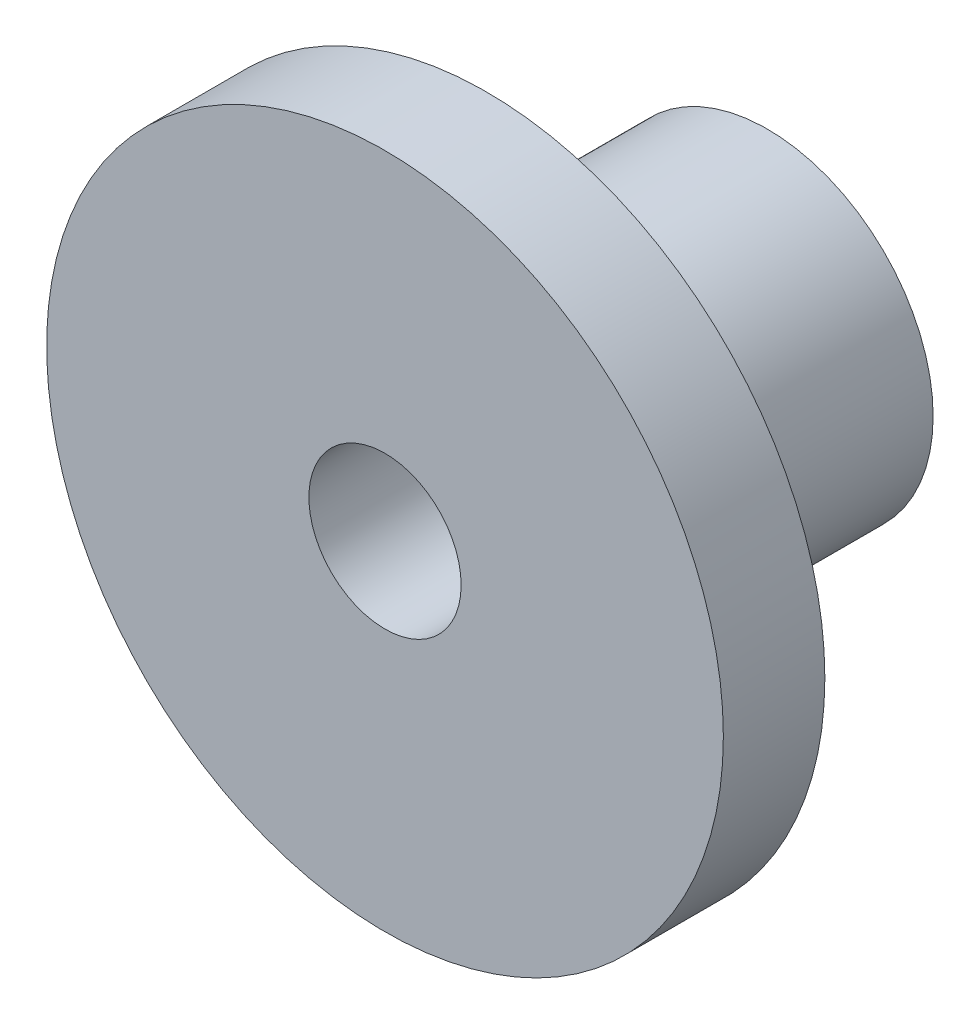
ISO-10303-21;
HEADER;
FILE_DESCRIPTION(('STEP AP214'),'2;1');
FILE_NAME('part.step','',(''),(''),'','','');
FILE_SCHEMA(('AUTOMOTIVE_DESIGN { 1 0 10303 214 1 1 1 1 }'));
ENDSEC;
DATA;
#1=APPLICATION_CONTEXT('core data for automotive mechanical design processes');
#2=APPLICATION_PROTOCOL_DEFINITION('international standard','automotive_design',2000,#1);
#3=PRODUCT_CONTEXT('',#1,'mechanical');
#4=PRODUCT('Part','Part','',(#3));
#5=PRODUCT_RELATED_PRODUCT_CATEGORY('part','',(#4));
#6=PRODUCT_DEFINITION_FORMATION('','',#4);
#7=PRODUCT_DEFINITION_CONTEXT('part definition',#1,'design');
#8=PRODUCT_DEFINITION('design','',#6,#7);
#9=PRODUCT_DEFINITION_SHAPE('','',#8);
#10=(LENGTH_UNIT() NAMED_UNIT(*) SI_UNIT(.MILLI.,.METRE.));
#11=(NAMED_UNIT(*) PLANE_ANGLE_UNIT() SI_UNIT($,.RADIAN.));
#12=(NAMED_UNIT(*) SI_UNIT($,.STERADIAN.) SOLID_ANGLE_UNIT());
#13=UNCERTAINTY_MEASURE_WITH_UNIT(LENGTH_MEASURE(1.E-05),#10,'distance_accuracy_value','');
#14=(GEOMETRIC_REPRESENTATION_CONTEXT(3) GLOBAL_UNCERTAINTY_ASSIGNED_CONTEXT((#13)) GLOBAL_UNIT_ASSIGNED_CONTEXT((#10,
#11,#12)) REPRESENTATION_CONTEXT('',''));
#15=CARTESIAN_POINT('',(0.,0.,0.));
#16=DIRECTION('',(0.,0.,1.));
#17=DIRECTION('',(1.,0.,0.));
#18=AXIS2_PLACEMENT_3D('',#15,#16,#17);
#19=CARTESIAN_POINT('',(0.,0.,-4.15));
#20=DIRECTION('',(0.,0.,1.));
#21=DIRECTION('',(1.,0.,0.));
#22=AXIS2_PLACEMENT_3D('',#19,#20,#21);
#23=PLANE('',#22);
#24=CARTESIAN_POINT('',(0.,0.,-4.15));
#25=DIRECTION('',(0.,0.,1.));
#26=DIRECTION('',(1.,0.,0.));
#27=AXIS2_PLACEMENT_3D('',#24,#25,#26);
#28=CIRCLE('',#27,4.9);
#29=CARTESIAN_POINT('',(4.9,0.,-4.15));
#30=VERTEX_POINT('',#29);
#31=EDGE_CURVE('E35',#30,#30,#28,.T.);
#32=ORIENTED_EDGE('',*,*,#31,.F.);
#33=EDGE_LOOP('',(#32));
#34=FACE_BOUND('',#33,.T.);
#35=CARTESIAN_POINT('',(0.,0.,-4.15));
#36=DIRECTION('',(0.,0.,1.));
#37=DIRECTION('',(1.,0.,0.));
#38=AXIS2_PLACEMENT_3D('',#35,#36,#37);
#39=CIRCLE('',#38,2.25);
#40=CARTESIAN_POINT('',(2.25,0.,-4.15));
#41=VERTEX_POINT('',#40);
#42=EDGE_CURVE('E42',#41,#41,#39,.T.);
#43=ORIENTED_EDGE('',*,*,#42,.T.);
#44=EDGE_LOOP('',(#43));
#45=FACE_BOUND('',#44,.T.);
#46=ADVANCED_FACE('F31',(#34,#45),#23,.F.);
#47=CARTESIAN_POINT('',(0.,0.,4.15));
#48=DIRECTION('',(0.,0.,-1.));
#49=DIRECTION('',(-1.,0.,0.));
#50=AXIS2_PLACEMENT_3D('',#47,#48,#49);
#51=CYLINDRICAL_SURFACE('',#50,4.9);
#52=CARTESIAN_POINT('',(0.,0.,4.15));
#53=DIRECTION('',(0.,0.,1.));
#54=DIRECTION('',(1.,0.,0.));
#55=AXIS2_PLACEMENT_3D('',#52,#53,#54);
#56=CIRCLE('',#55,4.9);
#57=CARTESIAN_POINT('',(4.9,0.,4.15));
#58=VERTEX_POINT('',#57);
#59=EDGE_CURVE('E10',#58,#58,#56,.T.);
#60=ORIENTED_EDGE('',*,*,#59,.F.);
#61=EDGE_LOOP('',(#60));
#62=FACE_BOUND('',#61,.T.);
#63=ORIENTED_EDGE('',*,*,#31,.T.);
#64=EDGE_LOOP('',(#63));
#65=FACE_BOUND('',#64,.T.);
#66=ADVANCED_FACE('F33',(#62,#65),#51,.T.);
#67=CARTESIAN_POINT('',(0.,0.,4.15));
#68=DIRECTION('',(0.,0.,-1.));
#69=DIRECTION('',(-1.,0.,0.));
#70=AXIS2_PLACEMENT_3D('',#67,#68,#69);
#71=CYLINDRICAL_SURFACE('',#70,2.25);
#72=ORIENTED_EDGE('',*,*,#42,.F.);
#73=EDGE_LOOP('',(#72));
#74=FACE_BOUND('',#73,.T.);
#75=CARTESIAN_POINT('',(0.,0.,7.15));
#76=DIRECTION('',(0.,0.,1.));
#77=DIRECTION('',(1.,0.,0.));
#78=AXIS2_PLACEMENT_3D('',#75,#76,#77);
#79=CIRCLE('',#78,2.25);
#80=CARTESIAN_POINT('',(2.25,0.,7.15));
#81=VERTEX_POINT('',#80);
#82=EDGE_CURVE('E50',#81,#81,#79,.T.);
#83=ORIENTED_EDGE('',*,*,#82,.T.);
#84=EDGE_LOOP('',(#83));
#85=FACE_BOUND('',#84,.T.);
#86=ADVANCED_FACE('F56',(#74,#85),#71,.F.);
#87=CARTESIAN_POINT('',(0.,0.,7.15));
#88=DIRECTION('',(0.,0.,1.));
#89=DIRECTION('',(1.,0.,0.));
#90=AXIS2_PLACEMENT_3D('',#87,#88,#89);
#91=PLANE('',#90);
#92=CARTESIAN_POINT('',(0.,0.,7.15));
#93=DIRECTION('',(0.,0.,1.));
#94=DIRECTION('',(1.,0.,0.));
#95=AXIS2_PLACEMENT_3D('',#92,#93,#94);
#96=CIRCLE('',#95,10.);
#97=CARTESIAN_POINT('',(10.,0.,7.15));
#98=VERTEX_POINT('',#97);
#99=EDGE_CURVE('E46',#98,#98,#96,.T.);
#100=ORIENTED_EDGE('',*,*,#99,.T.);
#101=EDGE_LOOP('',(#100));
#102=FACE_BOUND('',#101,.T.);
#103=ORIENTED_EDGE('',*,*,#82,.F.);
#104=EDGE_LOOP('',(#103));
#105=FACE_BOUND('',#104,.T.);
#106=ADVANCED_FACE('F58',(#102,#105),#91,.T.);
#107=CARTESIAN_POINT('',(0.,0.,4.15));
#108=DIRECTION('',(0.,0.,1.));
#109=DIRECTION('',(1.,0.,0.));
#110=AXIS2_PLACEMENT_3D('',#107,#108,#109);
#111=PLANE('',#110);
#112=ORIENTED_EDGE('',*,*,#59,.T.);
#113=EDGE_LOOP('',(#112));
#114=FACE_BOUND('',#113,.T.);
#115=CARTESIAN_POINT('',(0.,0.,4.15));
#116=DIRECTION('',(0.,0.,1.));
#117=DIRECTION('',(1.,0.,0.));
#118=AXIS2_PLACEMENT_3D('',#115,#116,#117);
#119=CIRCLE('',#118,10.);
#120=CARTESIAN_POINT('',(10.,0.,4.15));
#121=VERTEX_POINT('',#120);
#122=EDGE_CURVE('E47',#121,#121,#119,.T.);
#123=ORIENTED_EDGE('',*,*,#122,.F.);
#124=EDGE_LOOP('',(#123));
#125=FACE_BOUND('',#124,.T.);
#126=ADVANCED_FACE('F60',(#114,#125),#111,.F.);
#127=CARTESIAN_POINT('',(0.,0.,7.15));
#128=DIRECTION('',(0.,0.,-1.));
#129=DIRECTION('',(-1.,0.,0.));
#130=AXIS2_PLACEMENT_3D('',#127,#128,#129);
#131=CYLINDRICAL_SURFACE('',#130,10.);
#132=ORIENTED_EDGE('',*,*,#99,.F.);
#133=EDGE_LOOP('',(#132));
#134=FACE_BOUND('',#133,.T.);
#135=ORIENTED_EDGE('',*,*,#122,.T.);
#136=EDGE_LOOP('',(#135));
#137=FACE_BOUND('',#136,.T.);
#138=ADVANCED_FACE('F67',(#134,#137),#131,.T.);
#139=CLOSED_SHELL('',(#46,#66,#86,#106,#126,#138));
#140=MANIFOLD_SOLID_BREP('B2',#139);
#141=ADVANCED_BREP_SHAPE_REPRESENTATION('',(#18,#140),#14);
#142=SHAPE_DEFINITION_REPRESENTATION(#9,#141);
ENDSEC;
END-ISO-10303-21;
